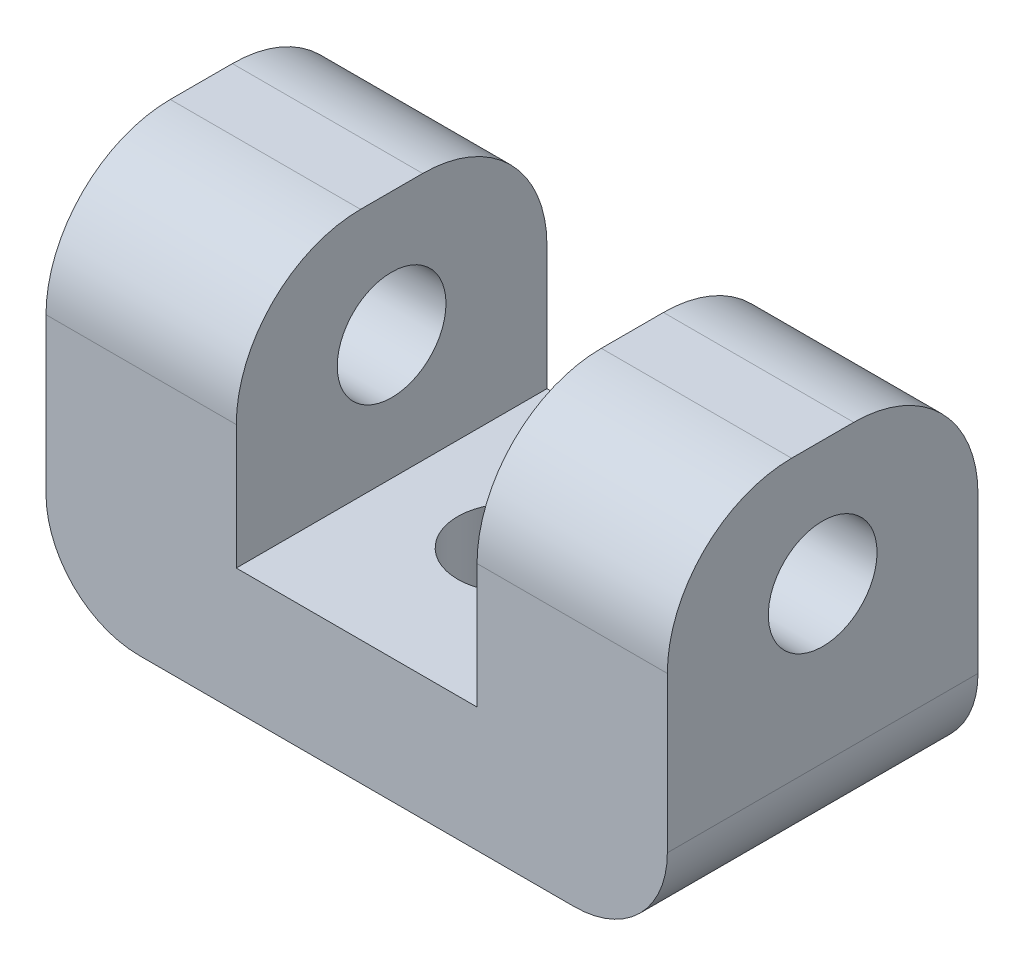
ISO-10303-21;
HEADER;
FILE_DESCRIPTION(('STEP AP214'),'2;1');
FILE_NAME('part.step','',(''),(''),'','','');
FILE_SCHEMA(('AUTOMOTIVE_DESIGN { 1 0 10303 214 1 1 1 1 }'));
ENDSEC;
DATA;
#1=APPLICATION_CONTEXT('core data for automotive mechanical design processes');
#2=APPLICATION_PROTOCOL_DEFINITION('international standard','automotive_design',2000,#1);
#3=PRODUCT_CONTEXT('',#1,'mechanical');
#4=PRODUCT('Part','Part','',(#3));
#5=PRODUCT_RELATED_PRODUCT_CATEGORY('part','',(#4));
#6=PRODUCT_DEFINITION_FORMATION('','',#4);
#7=PRODUCT_DEFINITION_CONTEXT('part definition',#1,'design');
#8=PRODUCT_DEFINITION('design','',#6,#7);
#9=PRODUCT_DEFINITION_SHAPE('','',#8);
#10=(LENGTH_UNIT() NAMED_UNIT(*) SI_UNIT(.MILLI.,.METRE.));
#11=(NAMED_UNIT(*) PLANE_ANGLE_UNIT() SI_UNIT($,.RADIAN.));
#12=(NAMED_UNIT(*) SI_UNIT($,.STERADIAN.) SOLID_ANGLE_UNIT());
#13=UNCERTAINTY_MEASURE_WITH_UNIT(LENGTH_MEASURE(1.E-05),#10,'distance_accuracy_value','');
#14=(GEOMETRIC_REPRESENTATION_CONTEXT(3) GLOBAL_UNCERTAINTY_ASSIGNED_CONTEXT((#13)) GLOBAL_UNIT_ASSIGNED_CONTEXT((#10,
#11,#12)) REPRESENTATION_CONTEXT('',''));
#15=CARTESIAN_POINT('',(0.,0.,0.));
#16=DIRECTION('',(0.,0.,1.));
#17=DIRECTION('',(1.,0.,0.));
#18=AXIS2_PLACEMENT_3D('',#15,#16,#17);
#19=CARTESIAN_POINT('',(0.,12.,0.));
#20=DIRECTION('',(0.,1.,0.));
#21=DIRECTION('',(0.,0.,1.));
#22=AXIS2_PLACEMENT_3D('',#19,#20,#21);
#23=PLANE('',#22);
#24=DIRECTION('',(0.,0.,1.));
#25=VECTOR('',#24,1.);
#26=CARTESIAN_POINT('',(-10.,12.,-5.));
#27=LINE('',#26,#25);
#28=CARTESIAN_POINT('',(-10.,12.,-1.));
#29=VERTEX_POINT('',#28);
#30=CARTESIAN_POINT('',(-10.,12.,1.));
#31=VERTEX_POINT('',#30);
#32=EDGE_CURVE('E203',#29,#31,#27,.T.);
#33=ORIENTED_EDGE('',*,*,#32,.T.);
#34=DIRECTION('',(1.,0.,0.));
#35=VECTOR('',#34,1.);
#36=CARTESIAN_POINT('',(-3.87494374283576,12.,1.));
#37=LINE('',#36,#35);
#38=CARTESIAN_POINT('',(-3.87494374283576,12.,1.));
#39=VERTEX_POINT('',#38);
#40=EDGE_CURVE('E233',#31,#39,#37,.T.);
#41=ORIENTED_EDGE('',*,*,#40,.T.);
#42=DIRECTION('',(0.,0.,1.));
#43=VECTOR('',#42,1.);
#44=CARTESIAN_POINT('',(-3.87494374283576,12.,-5.));
#45=LINE('',#44,#43);
#46=CARTESIAN_POINT('',(-3.87494374283576,12.,-1.));
#47=VERTEX_POINT('',#46);
#48=EDGE_CURVE('E182',#47,#39,#45,.T.);
#49=ORIENTED_EDGE('',*,*,#48,.F.);
#50=DIRECTION('',(-1.,0.,0.));
#51=VECTOR('',#50,1.);
#52=CARTESIAN_POINT('',(-10.,12.,-1.));
#53=LINE('',#52,#51);
#54=EDGE_CURVE('E229',#47,#29,#53,.T.);
#55=ORIENTED_EDGE('',*,*,#54,.T.);
#56=EDGE_LOOP('',(#33,#41,#49,#55));
#57=FACE_BOUND('',#56,.T.);
#58=ADVANCED_FACE('F42',(#57),#23,.T.);
#59=CARTESIAN_POINT('',(10.,12.,-5.));
#60=DIRECTION('',(-1.,0.,0.));
#61=DIRECTION('',(0.,0.,1.));
#62=AXIS2_PLACEMENT_3D('',#59,#60,#61);
#63=PLANE('',#62);
#64=CARTESIAN_POINT('',(10.,8.,0.));
#65=DIRECTION('',(1.,0.,0.));
#66=DIRECTION('',(0.,0.,-1.));
#67=AXIS2_PLACEMENT_3D('',#64,#65,#66);
#68=CIRCLE('',#67,1.75);
#69=CARTESIAN_POINT('',(10.,8.,-1.75));
#70=VERTEX_POINT('',#69);
#71=EDGE_CURVE('E417',#70,#70,#68,.T.);
#72=ORIENTED_EDGE('',*,*,#71,.F.);
#73=EDGE_LOOP('',(#72));
#74=FACE_BOUND('',#73,.T.);
#75=DIRECTION('',(0.,-1.,0.));
#76=VECTOR('',#75,1.);
#77=CARTESIAN_POINT('',(10.,12.,5.));
#78=LINE('',#77,#76);
#79=CARTESIAN_POINT('',(10.,8.,5.));
#80=VERTEX_POINT('',#79);
#81=CARTESIAN_POINT('',(10.,3.,5.));
#82=VERTEX_POINT('',#81);
#83=EDGE_CURVE('E208',#80,#82,#78,.T.);
#84=ORIENTED_EDGE('',*,*,#83,.T.);
#85=DIRECTION('',(0.,0.,-1.));
#86=VECTOR('',#85,1.);
#87=CARTESIAN_POINT('',(10.,3.,-5.));
#88=LINE('',#87,#86);
#89=CARTESIAN_POINT('',(10.,3.,-5.));
#90=VERTEX_POINT('',#89);
#91=EDGE_CURVE('E280',#82,#90,#88,.T.);
#92=ORIENTED_EDGE('',*,*,#91,.T.);
#93=DIRECTION('',(0.,-1.,0.));
#94=VECTOR('',#93,1.);
#95=CARTESIAN_POINT('',(10.,12.,-5.));
#96=LINE('',#95,#94);
#97=CARTESIAN_POINT('',(10.,8.,-5.));
#98=VERTEX_POINT('',#97);
#99=EDGE_CURVE('E225',#98,#90,#96,.T.);
#100=ORIENTED_EDGE('',*,*,#99,.F.);
#101=CARTESIAN_POINT('',(10.,8.,-1.));
#102=DIRECTION('',(-1.,0.,0.));
#103=DIRECTION('',(0.,0.,1.));
#104=AXIS2_PLACEMENT_3D('',#101,#102,#103);
#105=CIRCLE('',#104,4.);
#106=CARTESIAN_POINT('',(10.,12.,-1.));
#107=VERTEX_POINT('',#106);
#108=EDGE_CURVE('E277',#98,#107,#105,.F.);
#109=ORIENTED_EDGE('',*,*,#108,.T.);
#110=DIRECTION('',(0.,0.,-1.));
#111=VECTOR('',#110,1.);
#112=CARTESIAN_POINT('',(10.,12.,-5.));
#113=LINE('',#112,#111);
#114=CARTESIAN_POINT('',(10.,12.,1.));
#115=VERTEX_POINT('',#114);
#116=EDGE_CURVE('E199',#115,#107,#113,.T.);
#117=ORIENTED_EDGE('',*,*,#116,.F.);
#118=CARTESIAN_POINT('',(10.,8.,1.));
#119=DIRECTION('',(-1.,0.,0.));
#120=DIRECTION('',(0.,0.,1.));
#121=AXIS2_PLACEMENT_3D('',#118,#119,#120);
#122=CIRCLE('',#121,4.);
#123=EDGE_CURVE('E274',#115,#80,#122,.F.);
#124=ORIENTED_EDGE('',*,*,#123,.T.);
#125=EDGE_LOOP('',(#84,#92,#100,#109,#117,#124));
#126=FACE_BOUND('',#125,.T.);
#127=ADVANCED_FACE('F308',(#74,#126),#63,.F.);
#128=CARTESIAN_POINT('',(-10.,12.,-5.));
#129=DIRECTION('',(0.,0.,1.));
#130=DIRECTION('',(1.,0.,0.));
#131=AXIS2_PLACEMENT_3D('',#128,#129,#130);
#132=PLANE('',#131);
#133=ORIENTED_EDGE('',*,*,#99,.T.);
#134=CARTESIAN_POINT('',(7.,3.,-5.));
#135=DIRECTION('',(0.,0.,1.));
#136=DIRECTION('',(1.,0.,0.));
#137=AXIS2_PLACEMENT_3D('',#134,#135,#136);
#138=CIRCLE('',#137,3.);
#139=CARTESIAN_POINT('',(7.,0.,-5.));
#140=VERTEX_POINT('',#139);
#141=EDGE_CURVE('E292',#90,#140,#138,.F.);
#142=ORIENTED_EDGE('',*,*,#141,.T.);
#143=DIRECTION('',(-1.,0.,0.));
#144=VECTOR('',#143,1.);
#145=CARTESIAN_POINT('',(-10.,0.,-5.));
#146=LINE('',#145,#144);
#147=CARTESIAN_POINT('',(-7.,0.,-5.));
#148=VERTEX_POINT('',#147);
#149=EDGE_CURVE('E192',#140,#148,#146,.T.);
#150=ORIENTED_EDGE('',*,*,#149,.T.);
#151=CARTESIAN_POINT('',(-7.,3.,-5.));
#152=DIRECTION('',(0.,0.,1.));
#153=DIRECTION('',(1.,0.,0.));
#154=AXIS2_PLACEMENT_3D('',#151,#152,#153);
#155=CIRCLE('',#154,3.);
#156=CARTESIAN_POINT('',(-10.,3.,-5.));
#157=VERTEX_POINT('',#156);
#158=EDGE_CURVE('E289',#148,#157,#155,.F.);
#159=ORIENTED_EDGE('',*,*,#158,.T.);
#160=DIRECTION('',(0.,-1.,0.));
#161=VECTOR('',#160,1.);
#162=CARTESIAN_POINT('',(-10.,12.,-5.));
#163=LINE('',#162,#161);
#164=CARTESIAN_POINT('',(-10.,8.,-5.));
#165=VERTEX_POINT('',#164);
#166=EDGE_CURVE('E221',#165,#157,#163,.T.);
#167=ORIENTED_EDGE('',*,*,#166,.F.);
#168=DIRECTION('',(-1.,0.,0.));
#169=VECTOR('',#168,1.);
#170=CARTESIAN_POINT('',(-3.87494374283576,8.,-5.));
#171=LINE('',#170,#169);
#172=CARTESIAN_POINT('',(-3.87494374283576,8.,-5.));
#173=VERTEX_POINT('',#172);
#174=EDGE_CURVE('E257',#165,#173,#171,.F.);
#175=ORIENTED_EDGE('',*,*,#174,.T.);
#176=DIRECTION('',(0.,1.,0.));
#177=VECTOR('',#176,1.);
#178=CARTESIAN_POINT('',(-3.87494374283576,4.,-5.));
#179=LINE('',#178,#177);
#180=CARTESIAN_POINT('',(-3.87494374283576,4.,-5.));
#181=VERTEX_POINT('',#180);
#182=EDGE_CURVE('E189',#181,#173,#179,.T.);
#183=ORIENTED_EDGE('',*,*,#182,.F.);
#184=DIRECTION('',(-1.,0.,0.));
#185=VECTOR('',#184,1.);
#186=CARTESIAN_POINT('',(-3.87494374283576,4.,-5.));
#187=LINE('',#186,#185);
#188=CARTESIAN_POINT('',(3.87494374283576,4.,-5.));
#189=VERTEX_POINT('',#188);
#190=EDGE_CURVE('E158',#189,#181,#187,.T.);
#191=ORIENTED_EDGE('',*,*,#190,.F.);
#192=DIRECTION('',(0.,1.,0.));
#193=VECTOR('',#192,1.);
#194=CARTESIAN_POINT('',(3.87494374283576,4.,-5.));
#195=LINE('',#194,#193);
#196=CARTESIAN_POINT('',(3.87494374283576,8.,-5.));
#197=VERTEX_POINT('',#196);
#198=EDGE_CURVE('E193',#189,#197,#195,.T.);
#199=ORIENTED_EDGE('',*,*,#198,.T.);
#200=DIRECTION('',(-1.,0.,0.));
#201=VECTOR('',#200,1.);
#202=CARTESIAN_POINT('',(10.,8.,-5.));
#203=LINE('',#202,#201);
#204=EDGE_CURVE('E254',#197,#98,#203,.F.);
#205=ORIENTED_EDGE('',*,*,#204,.T.);
#206=EDGE_LOOP('',(#133,#142,#150,#159,#167,#175,#183,#191,#199,#205));
#207=FACE_BOUND('',#206,.T.);
#208=ADVANCED_FACE('F313',(#207),#132,.F.);
#209=CARTESIAN_POINT('',(-10.,12.,-5.));
#210=DIRECTION('',(1.,0.,0.));
#211=DIRECTION('',(0.,0.,-1.));
#212=AXIS2_PLACEMENT_3D('',#209,#210,#211);
#213=PLANE('',#212);
#214=CARTESIAN_POINT('',(-10.,8.,0.));
#215=DIRECTION('',(1.,0.,0.));
#216=DIRECTION('',(0.,0.,-1.));
#217=AXIS2_PLACEMENT_3D('',#214,#215,#216);
#218=CIRCLE('',#217,1.75);
#219=CARTESIAN_POINT('',(-10.,8.,-1.75));
#220=VERTEX_POINT('',#219);
#221=EDGE_CURVE('E285',#220,#220,#218,.T.);
#222=ORIENTED_EDGE('',*,*,#221,.T.);
#223=EDGE_LOOP('',(#222));
#224=FACE_BOUND('',#223,.T.);
#225=ORIENTED_EDGE('',*,*,#166,.T.);
#226=DIRECTION('',(0.,0.,1.));
#227=VECTOR('',#226,1.);
#228=CARTESIAN_POINT('',(-10.,3.,-5.));
#229=LINE('',#228,#227);
#230=CARTESIAN_POINT('',(-10.,3.,5.));
#231=VERTEX_POINT('',#230);
#232=EDGE_CURVE('E11',#157,#231,#229,.T.);
#233=ORIENTED_EDGE('',*,*,#232,.T.);
#234=DIRECTION('',(0.,-1.,0.));
#235=VECTOR('',#234,1.);
#236=CARTESIAN_POINT('',(-10.,12.,5.));
#237=LINE('',#236,#235);
#238=CARTESIAN_POINT('',(-10.,8.,5.));
#239=VERTEX_POINT('',#238);
#240=EDGE_CURVE('E217',#239,#231,#237,.T.);
#241=ORIENTED_EDGE('',*,*,#240,.F.);
#242=CARTESIAN_POINT('',(-10.,8.,1.));
#243=DIRECTION('',(1.,0.,0.));
#244=DIRECTION('',(0.,0.,-1.));
#245=AXIS2_PLACEMENT_3D('',#242,#243,#244);
#246=CIRCLE('',#245,4.);
#247=EDGE_CURVE('E251',#239,#31,#246,.F.);
#248=ORIENTED_EDGE('',*,*,#247,.T.);
#249=ORIENTED_EDGE('',*,*,#32,.F.);
#250=CARTESIAN_POINT('',(-10.,8.,-1.));
#251=DIRECTION('',(1.,0.,0.));
#252=DIRECTION('',(0.,0.,-1.));
#253=AXIS2_PLACEMENT_3D('',#250,#251,#252);
#254=CIRCLE('',#253,4.);
#255=EDGE_CURVE('E248',#29,#165,#254,.F.);
#256=ORIENTED_EDGE('',*,*,#255,.T.);
#257=EDGE_LOOP('',(#225,#233,#241,#248,#249,#256));
#258=FACE_BOUND('',#257,.T.);
#259=ADVANCED_FACE('F319',(#224,#258),#213,.F.);
#260=CARTESIAN_POINT('',(-10.,12.,5.));
#261=DIRECTION('',(0.,0.,-1.));
#262=DIRECTION('',(-1.,0.,0.));
#263=AXIS2_PLACEMENT_3D('',#260,#261,#262);
#264=PLANE('',#263);
#265=DIRECTION('',(1.,0.,0.));
#266=VECTOR('',#265,1.);
#267=CARTESIAN_POINT('',(-10.,0.,5.));
#268=LINE('',#267,#266);
#269=CARTESIAN_POINT('',(-7.,0.,5.));
#270=VERTEX_POINT('',#269);
#271=CARTESIAN_POINT('',(7.,0.,5.));
#272=VERTEX_POINT('',#271);
#273=EDGE_CURVE('E204',#270,#272,#268,.T.);
#274=ORIENTED_EDGE('',*,*,#273,.T.);
#275=CARTESIAN_POINT('',(7.,3.,5.));
#276=DIRECTION('',(0.,0.,-1.));
#277=DIRECTION('',(-1.,0.,0.));
#278=AXIS2_PLACEMENT_3D('',#275,#276,#277);
#279=CIRCLE('',#278,3.);
#280=EDGE_CURVE('E51',#272,#82,#279,.F.);
#281=ORIENTED_EDGE('',*,*,#280,.T.);
#282=ORIENTED_EDGE('',*,*,#83,.F.);
#283=DIRECTION('',(1.,0.,0.));
#284=VECTOR('',#283,1.);
#285=CARTESIAN_POINT('',(3.87494374283576,8.,5.));
#286=LINE('',#285,#284);
#287=CARTESIAN_POINT('',(3.87494374283576,8.,5.));
#288=VERTEX_POINT('',#287);
#289=EDGE_CURVE('E242',#80,#288,#286,.F.);
#290=ORIENTED_EDGE('',*,*,#289,.T.);
#291=DIRECTION('',(0.,1.,0.));
#292=VECTOR('',#291,1.);
#293=CARTESIAN_POINT('',(3.87494374283576,4.,5.));
#294=LINE('',#293,#292);
#295=CARTESIAN_POINT('',(3.87494374283576,4.,5.));
#296=VERTEX_POINT('',#295);
#297=EDGE_CURVE('E157',#296,#288,#294,.T.);
#298=ORIENTED_EDGE('',*,*,#297,.F.);
#299=DIRECTION('',(1.,0.,0.));
#300=VECTOR('',#299,1.);
#301=CARTESIAN_POINT('',(-3.87494374283576,4.,5.));
#302=LINE('',#301,#300);
#303=CARTESIAN_POINT('',(-3.87494374283576,4.,5.));
#304=VERTEX_POINT('',#303);
#305=EDGE_CURVE('E164',#304,#296,#302,.T.);
#306=ORIENTED_EDGE('',*,*,#305,.F.);
#307=DIRECTION('',(0.,1.,0.));
#308=VECTOR('',#307,1.);
#309=CARTESIAN_POINT('',(-3.87494374283576,4.,5.));
#310=LINE('',#309,#308);
#311=CARTESIAN_POINT('',(-3.87494374283576,8.,5.));
#312=VERTEX_POINT('',#311);
#313=EDGE_CURVE('E145',#304,#312,#310,.T.);
#314=ORIENTED_EDGE('',*,*,#313,.T.);
#315=DIRECTION('',(1.,0.,0.));
#316=VECTOR('',#315,1.);
#317=CARTESIAN_POINT('',(-10.,8.,5.));
#318=LINE('',#317,#316);
#319=EDGE_CURVE('E245',#312,#239,#318,.F.);
#320=ORIENTED_EDGE('',*,*,#319,.T.);
#321=ORIENTED_EDGE('',*,*,#240,.T.);
#322=CARTESIAN_POINT('',(-7.,3.,5.));
#323=DIRECTION('',(0.,0.,-1.));
#324=DIRECTION('',(-1.,0.,0.));
#325=AXIS2_PLACEMENT_3D('',#322,#323,#324);
#326=CIRCLE('',#325,3.);
#327=EDGE_CURVE('E58',#231,#270,#326,.F.);
#328=ORIENTED_EDGE('',*,*,#327,.T.);
#329=EDGE_LOOP('',(#274,#281,#282,#290,#298,#306,#314,#320,#321,#328));
#330=FACE_BOUND('',#329,.T.);
#331=ADVANCED_FACE('F171',(#330),#264,.F.);
#332=ORIENTED_EDGE('',*,*,#116,.T.);
#333=DIRECTION('',(-1.,0.,0.));
#334=VECTOR('',#333,1.);
#335=CARTESIAN_POINT('',(3.87494374283576,12.,-1.));
#336=LINE('',#335,#334);
#337=CARTESIAN_POINT('',(3.87494374283576,12.,-1.));
#338=VERTEX_POINT('',#337);
#339=EDGE_CURVE('E264',#107,#338,#336,.T.);
#340=ORIENTED_EDGE('',*,*,#339,.T.);
#341=DIRECTION('',(0.,0.,-1.));
#342=VECTOR('',#341,1.);
#343=CARTESIAN_POINT('',(3.87494374283576,12.,-5.));
#344=LINE('',#343,#342);
#345=CARTESIAN_POINT('',(3.87494374283576,12.,1.));
#346=VERTEX_POINT('',#345);
#347=EDGE_CURVE('E169',#346,#338,#344,.T.);
#348=ORIENTED_EDGE('',*,*,#347,.F.);
#349=DIRECTION('',(1.,0.,0.));
#350=VECTOR('',#349,1.);
#351=CARTESIAN_POINT('',(10.,12.,1.));
#352=LINE('',#351,#350);
#353=EDGE_CURVE('E260',#346,#115,#352,.T.);
#354=ORIENTED_EDGE('',*,*,#353,.T.);
#355=EDGE_LOOP('',(#332,#340,#348,#354));
#356=FACE_BOUND('',#355,.T.);
#357=ADVANCED_FACE('F336',(#356),#23,.T.);
#358=CARTESIAN_POINT('',(0.,0.,0.));
#359=DIRECTION('',(0.,1.,0.));
#360=DIRECTION('',(0.,0.,1.));
#361=AXIS2_PLACEMENT_3D('',#358,#359,#360);
#362=PLANE('',#361);
#363=CARTESIAN_POINT('',(0.,0.,0.));
#364=DIRECTION('',(0.,1.,0.));
#365=DIRECTION('',(0.,0.,1.));
#366=AXIS2_PLACEMENT_3D('',#363,#364,#365);
#367=CIRCLE('',#366,1.75);
#368=CARTESIAN_POINT('',(0.,0.,1.75));
#369=VERTEX_POINT('',#368);
#370=EDGE_CURVE('E410',#369,#369,#367,.T.);
#371=ORIENTED_EDGE('',*,*,#370,.T.);
#372=EDGE_LOOP('',(#371));
#373=FACE_BOUND('',#372,.T.);
#374=ORIENTED_EDGE('',*,*,#149,.F.);
#375=DIRECTION('',(0.,0.,-1.));
#376=VECTOR('',#375,1.);
#377=CARTESIAN_POINT('',(7.,0.,0.));
#378=LINE('',#377,#376);
#379=EDGE_CURVE('E65',#140,#272,#378,.F.);
#380=ORIENTED_EDGE('',*,*,#379,.T.);
#381=ORIENTED_EDGE('',*,*,#273,.F.);
#382=DIRECTION('',(0.,0.,1.));
#383=VECTOR('',#382,1.);
#384=CARTESIAN_POINT('',(-7.,0.,0.));
#385=LINE('',#384,#383);
#386=EDGE_CURVE('E295',#270,#148,#385,.F.);
#387=ORIENTED_EDGE('',*,*,#386,.T.);
#388=EDGE_LOOP('',(#374,#380,#381,#387));
#389=FACE_BOUND('',#388,.T.);
#390=ADVANCED_FACE('F315',(#373,#389),#362,.F.);
#391=CARTESIAN_POINT('',(-3.87494374283576,4.,-5.));
#392=DIRECTION('',(-1.,0.,0.));
#393=DIRECTION('',(0.,0.,1.));
#394=AXIS2_PLACEMENT_3D('',#391,#392,#393);
#395=PLANE('',#394);
#396=CARTESIAN_POINT('',(-3.87494374283576,8.,0.));
#397=DIRECTION('',(-1.,0.,0.));
#398=DIRECTION('',(0.,0.,1.));
#399=AXIS2_PLACEMENT_3D('',#396,#397,#398);
#400=CIRCLE('',#399,1.75);
#401=CARTESIAN_POINT('',(-3.87494374283576,8.,1.75));
#402=VERTEX_POINT('',#401);
#403=EDGE_CURVE('E185',#402,#402,#400,.T.);
#404=ORIENTED_EDGE('',*,*,#403,.T.);
#405=EDGE_LOOP('',(#404));
#406=FACE_BOUND('',#405,.T.);
#407=ORIENTED_EDGE('',*,*,#48,.T.);
#408=CARTESIAN_POINT('',(-3.87494374283576,8.,1.));
#409=DIRECTION('',(-1.,0.,0.));
#410=DIRECTION('',(0.,0.,1.));
#411=AXIS2_PLACEMENT_3D('',#408,#409,#410);
#412=CIRCLE('',#411,4.);
#413=EDGE_CURVE('E152',#39,#312,#412,.F.);
#414=ORIENTED_EDGE('',*,*,#413,.T.);
#415=ORIENTED_EDGE('',*,*,#313,.F.);
#416=DIRECTION('',(0.,0.,1.));
#417=VECTOR('',#416,1.);
#418=CARTESIAN_POINT('',(-3.87494374283576,4.,-5.));
#419=LINE('',#418,#417);
#420=EDGE_CURVE('E150',#181,#304,#419,.T.);
#421=ORIENTED_EDGE('',*,*,#420,.F.);
#422=ORIENTED_EDGE('',*,*,#182,.T.);
#423=CARTESIAN_POINT('',(-3.87494374283576,8.,-1.));
#424=DIRECTION('',(-1.,0.,0.));
#425=DIRECTION('',(0.,0.,1.));
#426=AXIS2_PLACEMENT_3D('',#423,#424,#425);
#427=CIRCLE('',#426,4.);
#428=EDGE_CURVE('E237',#173,#47,#427,.F.);
#429=ORIENTED_EDGE('',*,*,#428,.T.);
#430=EDGE_LOOP('',(#407,#414,#415,#421,#422,#429));
#431=FACE_BOUND('',#430,.T.);
#432=ADVANCED_FACE('F148',(#406,#431),#395,.F.);
#433=CARTESIAN_POINT('',(3.87494374283576,4.,-5.));
#434=DIRECTION('',(1.,0.,0.));
#435=DIRECTION('',(0.,0.,-1.));
#436=AXIS2_PLACEMENT_3D('',#433,#434,#435);
#437=PLANE('',#436);
#438=CARTESIAN_POINT('',(3.87494374283576,8.,0.));
#439=DIRECTION('',(1.,0.,0.));
#440=DIRECTION('',(0.,0.,-1.));
#441=AXIS2_PLACEMENT_3D('',#438,#439,#440);
#442=CIRCLE('',#441,1.75);
#443=CARTESIAN_POINT('',(3.87494374283576,8.,-1.75));
#444=VERTEX_POINT('',#443);
#445=EDGE_CURVE('E281',#444,#444,#442,.T.);
#446=ORIENTED_EDGE('',*,*,#445,.T.);
#447=EDGE_LOOP('',(#446));
#448=FACE_BOUND('',#447,.T.);
#449=ORIENTED_EDGE('',*,*,#347,.T.);
#450=CARTESIAN_POINT('',(3.87494374283576,8.,-1.));
#451=DIRECTION('',(1.,0.,0.));
#452=DIRECTION('',(0.,0.,-1.));
#453=AXIS2_PLACEMENT_3D('',#450,#451,#452);
#454=CIRCLE('',#453,4.);
#455=EDGE_CURVE('E271',#338,#197,#454,.F.);
#456=ORIENTED_EDGE('',*,*,#455,.T.);
#457=ORIENTED_EDGE('',*,*,#198,.F.);
#458=DIRECTION('',(0.,0.,-1.));
#459=VECTOR('',#458,1.);
#460=CARTESIAN_POINT('',(3.87494374283576,4.,-5.));
#461=LINE('',#460,#459);
#462=EDGE_CURVE('E174',#296,#189,#461,.T.);
#463=ORIENTED_EDGE('',*,*,#462,.F.);
#464=ORIENTED_EDGE('',*,*,#297,.T.);
#465=CARTESIAN_POINT('',(3.87494374283576,8.,1.));
#466=DIRECTION('',(1.,0.,0.));
#467=DIRECTION('',(0.,0.,-1.));
#468=AXIS2_PLACEMENT_3D('',#465,#466,#467);
#469=CIRCLE('',#468,4.);
#470=EDGE_CURVE('E268',#288,#346,#469,.F.);
#471=ORIENTED_EDGE('',*,*,#470,.T.);
#472=EDGE_LOOP('',(#449,#456,#457,#463,#464,#471));
#473=FACE_BOUND('',#472,.T.);
#474=ADVANCED_FACE('F342',(#448,#473),#437,.F.);
#475=CARTESIAN_POINT('',(0.,4.,0.));
#476=DIRECTION('',(0.,1.,0.));
#477=DIRECTION('',(0.,0.,1.));
#478=AXIS2_PLACEMENT_3D('',#475,#476,#477);
#479=PLANE('',#478);
#480=CARTESIAN_POINT('',(0.,4.,0.));
#481=DIRECTION('',(0.,1.,0.));
#482=DIRECTION('',(0.,0.,1.));
#483=AXIS2_PLACEMENT_3D('',#480,#481,#482);
#484=CIRCLE('',#483,1.75);
#485=CARTESIAN_POINT('',(0.,4.,1.75));
#486=VERTEX_POINT('',#485);
#487=EDGE_CURVE('E413',#486,#486,#484,.T.);
#488=ORIENTED_EDGE('',*,*,#487,.F.);
#489=EDGE_LOOP('',(#488));
#490=FACE_BOUND('',#489,.T.);
#491=ORIENTED_EDGE('',*,*,#420,.T.);
#492=ORIENTED_EDGE('',*,*,#305,.T.);
#493=ORIENTED_EDGE('',*,*,#462,.T.);
#494=ORIENTED_EDGE('',*,*,#190,.T.);
#495=EDGE_LOOP('',(#491,#492,#493,#494));
#496=FACE_BOUND('',#495,.T.);
#497=ADVANCED_FACE('F162',(#490,#496),#479,.T.);
#498=CARTESIAN_POINT('',(0.,8.,1.));
#499=DIRECTION('',(-1.,0.,0.));
#500=DIRECTION('',(0.,0.,1.));
#501=AXIS2_PLACEMENT_3D('',#498,#499,#500);
#502=CYLINDRICAL_SURFACE('',#501,4.);
#503=ORIENTED_EDGE('',*,*,#247,.F.);
#504=ORIENTED_EDGE('',*,*,#319,.F.);
#505=ORIENTED_EDGE('',*,*,#413,.F.);
#506=ORIENTED_EDGE('',*,*,#40,.F.);
#507=EDGE_LOOP('',(#503,#504,#505,#506));
#508=FACE_BOUND('',#507,.T.);
#509=ADVANCED_FACE('F350',(#508),#502,.T.);
#510=CARTESIAN_POINT('',(0.,8.,-1.));
#511=DIRECTION('',(1.,0.,0.));
#512=DIRECTION('',(0.,0.,-1.));
#513=AXIS2_PLACEMENT_3D('',#510,#511,#512);
#514=CYLINDRICAL_SURFACE('',#513,4.);
#515=ORIENTED_EDGE('',*,*,#428,.F.);
#516=ORIENTED_EDGE('',*,*,#174,.F.);
#517=ORIENTED_EDGE('',*,*,#255,.F.);
#518=ORIENTED_EDGE('',*,*,#54,.F.);
#519=EDGE_LOOP('',(#515,#516,#517,#518));
#520=FACE_BOUND('',#519,.T.);
#521=ADVANCED_FACE('F325',(#520),#514,.T.);
#522=CARTESIAN_POINT('',(0.,8.,-1.));
#523=DIRECTION('',(1.,0.,0.));
#524=DIRECTION('',(0.,0.,-1.));
#525=AXIS2_PLACEMENT_3D('',#522,#523,#524);
#526=CYLINDRICAL_SURFACE('',#525,4.);
#527=ORIENTED_EDGE('',*,*,#108,.F.);
#528=ORIENTED_EDGE('',*,*,#204,.F.);
#529=ORIENTED_EDGE('',*,*,#455,.F.);
#530=ORIENTED_EDGE('',*,*,#339,.F.);
#531=EDGE_LOOP('',(#527,#528,#529,#530));
#532=FACE_BOUND('',#531,.T.);
#533=ADVANCED_FACE('F333',(#532),#526,.T.);
#534=CARTESIAN_POINT('',(0.,8.,1.));
#535=DIRECTION('',(-1.,0.,0.));
#536=DIRECTION('',(0.,0.,1.));
#537=AXIS2_PLACEMENT_3D('',#534,#535,#536);
#538=CYLINDRICAL_SURFACE('',#537,4.);
#539=ORIENTED_EDGE('',*,*,#470,.F.);
#540=ORIENTED_EDGE('',*,*,#289,.F.);
#541=ORIENTED_EDGE('',*,*,#123,.F.);
#542=ORIENTED_EDGE('',*,*,#353,.F.);
#543=EDGE_LOOP('',(#539,#540,#541,#542));
#544=FACE_BOUND('',#543,.T.);
#545=ADVANCED_FACE('F341',(#544),#538,.T.);
#546=CARTESIAN_POINT('',(-10.,8.,0.));
#547=DIRECTION('',(1.,0.,0.));
#548=DIRECTION('',(0.,0.,-1.));
#549=AXIS2_PLACEMENT_3D('',#546,#547,#548);
#550=CYLINDRICAL_SURFACE('',#549,1.75);
#551=ORIENTED_EDGE('',*,*,#71,.T.);
#552=EDGE_LOOP('',(#551));
#553=FACE_BOUND('',#552,.T.);
#554=ORIENTED_EDGE('',*,*,#445,.F.);
#555=EDGE_LOOP('',(#554));
#556=FACE_BOUND('',#555,.T.);
#557=ADVANCED_FACE('F386',(#553,#556),#550,.F.);
#558=ORIENTED_EDGE('',*,*,#221,.F.);
#559=EDGE_LOOP('',(#558));
#560=FACE_BOUND('',#559,.T.);
#561=ORIENTED_EDGE('',*,*,#403,.F.);
#562=EDGE_LOOP('',(#561));
#563=FACE_BOUND('',#562,.T.);
#564=ADVANCED_FACE('F388',(#560,#563),#550,.F.);
#565=CARTESIAN_POINT('',(7.,3.,-5.));
#566=DIRECTION('',(0.,0.,-1.));
#567=DIRECTION('',(-1.,0.,0.));
#568=AXIS2_PLACEMENT_3D('',#565,#566,#567);
#569=CYLINDRICAL_SURFACE('',#568,3.);
#570=ORIENTED_EDGE('',*,*,#280,.F.);
#571=ORIENTED_EDGE('',*,*,#379,.F.);
#572=ORIENTED_EDGE('',*,*,#141,.F.);
#573=ORIENTED_EDGE('',*,*,#91,.F.);
#574=EDGE_LOOP('',(#570,#571,#572,#573));
#575=FACE_BOUND('',#574,.T.);
#576=ADVANCED_FACE('F311',(#575),#569,.T.);
#577=CARTESIAN_POINT('',(-7.,3.,-5.));
#578=DIRECTION('',(0.,0.,1.));
#579=DIRECTION('',(1.,0.,0.));
#580=AXIS2_PLACEMENT_3D('',#577,#578,#579);
#581=CYLINDRICAL_SURFACE('',#580,3.);
#582=ORIENTED_EDGE('',*,*,#158,.F.);
#583=ORIENTED_EDGE('',*,*,#386,.F.);
#584=ORIENTED_EDGE('',*,*,#327,.F.);
#585=ORIENTED_EDGE('',*,*,#232,.F.);
#586=EDGE_LOOP('',(#582,#583,#584,#585));
#587=FACE_BOUND('',#586,.T.);
#588=ADVANCED_FACE('F44',(#587),#581,.T.);
#589=CARTESIAN_POINT('',(0.,0.,0.));
#590=DIRECTION('',(0.,1.,0.));
#591=DIRECTION('',(0.,0.,1.));
#592=AXIS2_PLACEMENT_3D('',#589,#590,#591);
#593=CYLINDRICAL_SURFACE('',#592,1.75);
#594=ORIENTED_EDGE('',*,*,#370,.F.);
#595=EDGE_LOOP('',(#594));
#596=FACE_BOUND('',#595,.T.);
#597=ORIENTED_EDGE('',*,*,#487,.T.);
#598=EDGE_LOOP('',(#597));
#599=FACE_BOUND('',#598,.T.);
#600=ADVANCED_FACE('F393',(#596,#599),#593,.F.);
#601=CLOSED_SHELL('',(#58,#127,#208,#259,#331,#357,#390,#432,#474,#497,#509,#521,#533,#545,#557,
#564,#576,#588,#600));
#602=MANIFOLD_SOLID_BREP('B2',#601);
#603=ADVANCED_BREP_SHAPE_REPRESENTATION('',(#18,#602),#14);
#604=SHAPE_DEFINITION_REPRESENTATION(#9,#603);
ENDSEC;
END-ISO-10303-21;
